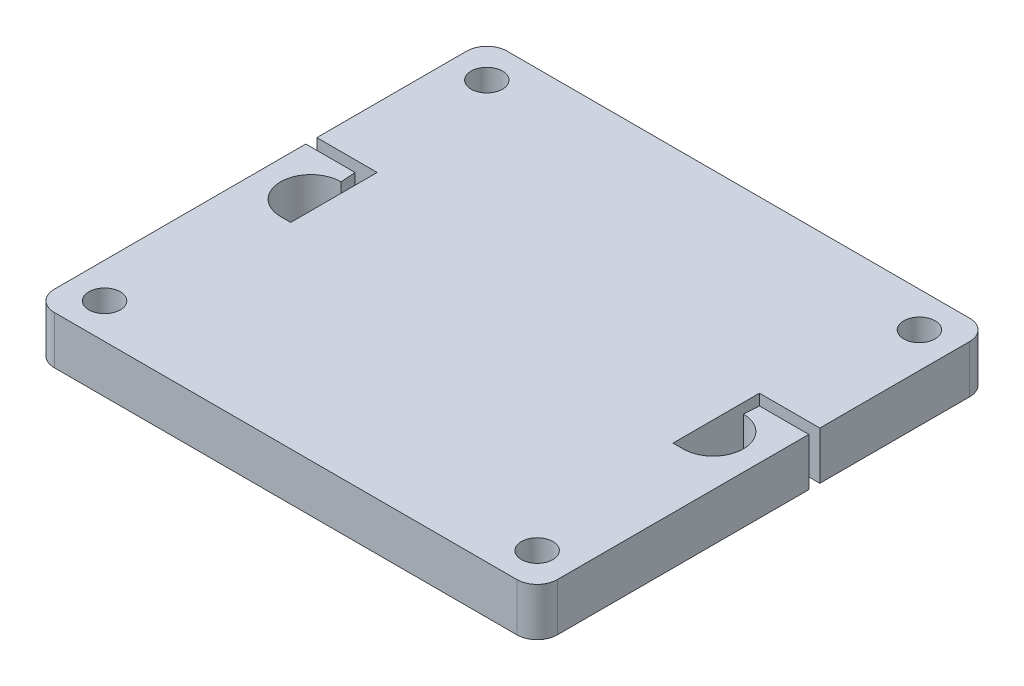
ISO-10303-21;
HEADER;
FILE_DESCRIPTION(('STEP AP214'),'2;1');
FILE_NAME('part.step','',(''),(''),'','','');
FILE_SCHEMA(('AUTOMOTIVE_DESIGN { 1 0 10303 214 1 1 1 1 }'));
ENDSEC;
DATA;
#1=APPLICATION_CONTEXT('core data for automotive mechanical design processes');
#2=APPLICATION_PROTOCOL_DEFINITION('international standard','automotive_design',2000,#1);
#3=PRODUCT_CONTEXT('',#1,'mechanical');
#4=PRODUCT('Part','Part','',(#3));
#5=PRODUCT_RELATED_PRODUCT_CATEGORY('part','',(#4));
#6=PRODUCT_DEFINITION_FORMATION('','',#4);
#7=PRODUCT_DEFINITION_CONTEXT('part definition',#1,'design');
#8=PRODUCT_DEFINITION('design','',#6,#7);
#9=PRODUCT_DEFINITION_SHAPE('','',#8);
#10=(LENGTH_UNIT() NAMED_UNIT(*) SI_UNIT(.MILLI.,.METRE.));
#11=(NAMED_UNIT(*) PLANE_ANGLE_UNIT() SI_UNIT($,.RADIAN.));
#12=(NAMED_UNIT(*) SI_UNIT($,.STERADIAN.) SOLID_ANGLE_UNIT());
#13=UNCERTAINTY_MEASURE_WITH_UNIT(LENGTH_MEASURE(1.E-05),#10,'distance_accuracy_value','');
#14=(GEOMETRIC_REPRESENTATION_CONTEXT(3) GLOBAL_UNCERTAINTY_ASSIGNED_CONTEXT((#13)) GLOBAL_UNIT_ASSIGNED_CONTEXT((#10,
#11,#12)) REPRESENTATION_CONTEXT('',''));
#15=CARTESIAN_POINT('',(0.,0.,0.));
#16=DIRECTION('',(0.,0.,1.));
#17=DIRECTION('',(1.,0.,0.));
#18=AXIS2_PLACEMENT_3D('',#15,#16,#17);
#19=CARTESIAN_POINT('',(-25.,4.7625,22.5));
#20=DIRECTION('',(0.,1.,0.));
#21=DIRECTION('',(0.,0.,1.));
#22=AXIS2_PLACEMENT_3D('',#19,#20,#21);
#23=PLANE('',#22);
#24=CARTESIAN_POINT('',(-21.5,4.7625,19.));
#25=DIRECTION('',(0.,1.,0.));
#26=DIRECTION('',(0.,0.,-1.));
#27=AXIS2_PLACEMENT_3D('',#24,#25,#26);
#28=CIRCLE('',#27,1.5625);
#29=CARTESIAN_POINT('',(-21.5,4.7625,17.4375));
#30=VERTEX_POINT('',#29);
#31=EDGE_CURVE('E286',#30,#30,#28,.T.);
#32=ORIENTED_EDGE('',*,*,#31,.F.);
#33=EDGE_LOOP('',(#32));
#34=FACE_BOUND('',#33,.T.);
#35=CARTESIAN_POINT('',(21.5,4.7625,-19.));
#36=DIRECTION('',(0.,1.,0.));
#37=DIRECTION('',(0.,0.,-1.));
#38=AXIS2_PLACEMENT_3D('',#35,#36,#37);
#39=CIRCLE('',#38,1.5625);
#40=CARTESIAN_POINT('',(21.5,4.7625,-20.5625));
#41=VERTEX_POINT('',#40);
#42=EDGE_CURVE('E298',#41,#41,#39,.T.);
#43=ORIENTED_EDGE('',*,*,#42,.F.);
#44=EDGE_LOOP('',(#43));
#45=FACE_BOUND('',#44,.T.);
#46=CARTESIAN_POINT('',(-21.5,4.7625,-19.));
#47=DIRECTION('',(0.,1.,0.));
#48=DIRECTION('',(0.,0.,1.));
#49=AXIS2_PLACEMENT_3D('',#46,#47,#48);
#50=CIRCLE('',#49,1.5625);
#51=CARTESIAN_POINT('',(-21.5,4.7625,-17.4375));
#52=VERTEX_POINT('',#51);
#53=EDGE_CURVE('E304',#52,#52,#50,.T.);
#54=ORIENTED_EDGE('',*,*,#53,.F.);
#55=EDGE_LOOP('',(#54));
#56=FACE_BOUND('',#55,.T.);
#57=CARTESIAN_POINT('',(21.5,4.7625,19.));
#58=DIRECTION('',(0.,1.,0.));
#59=DIRECTION('',(0.,0.,1.));
#60=AXIS2_PLACEMENT_3D('',#57,#58,#59);
#61=CIRCLE('',#60,1.5625);
#62=CARTESIAN_POINT('',(21.5,4.7625,20.5625));
#63=VERTEX_POINT('',#62);
#64=EDGE_CURVE('E292',#63,#63,#61,.T.);
#65=ORIENTED_EDGE('',*,*,#64,.F.);
#66=EDGE_LOOP('',(#65));
#67=FACE_BOUND('',#66,.T.);
#68=DIRECTION('',(0.,0.,-1.));
#69=VECTOR('',#68,1.);
#70=CARTESIAN_POINT('',(25.,4.7625,-22.5));
#71=LINE('',#70,#69);
#72=CARTESIAN_POINT('',(25.,4.7625,20.5));
#73=VERTEX_POINT('',#72);
#74=CARTESIAN_POINT('',(25.,4.7625,-4.5));
#75=VERTEX_POINT('',#74);
#76=EDGE_CURVE('E318',#73,#75,#71,.T.);
#77=ORIENTED_EDGE('',*,*,#76,.T.);
#78=DIRECTION('',(-1.,0.,0.));
#79=VECTOR('',#78,1.);
#80=CARTESIAN_POINT('',(20.1,4.7625,-4.5));
#81=LINE('',#80,#79);
#82=CARTESIAN_POINT('',(20.1,4.7625,-4.5));
#83=VERTEX_POINT('',#82);
#84=EDGE_CURVE('E202',#75,#83,#81,.T.);
#85=ORIENTED_EDGE('',*,*,#84,.T.);
#86=DIRECTION('',(-0.0665190105237735,0.,0.997785157856609));
#87=VECTOR('',#86,1.);
#88=CARTESIAN_POINT('',(20.,4.7625,-3.));
#89=LINE('',#88,#87);
#90=CARTESIAN_POINT('',(20.,4.7625,-3.));
#91=VERTEX_POINT('',#90);
#92=EDGE_CURVE('E205',#83,#91,#89,.T.);
#93=ORIENTED_EDGE('',*,*,#92,.T.);
#94=CARTESIAN_POINT('',(20.,4.7625,0.));
#95=DIRECTION('',(0.,-1.,0.));
#96=DIRECTION('',(0.,0.,-1.));
#97=AXIS2_PLACEMENT_3D('',#94,#95,#96);
#98=CIRCLE('',#97,3.);
#99=CARTESIAN_POINT('',(20.,4.7625,3.));
#100=VERTEX_POINT('',#99);
#101=EDGE_CURVE('E221',#91,#100,#98,.T.);
#102=ORIENTED_EDGE('',*,*,#101,.T.);
#103=DIRECTION('',(-1.,0.,0.));
#104=VECTOR('',#103,1.);
#105=CARTESIAN_POINT('',(20.,4.7625,3.));
#106=LINE('',#105,#104);
#107=CARTESIAN_POINT('',(19.,4.7625,3.));
#108=VERTEX_POINT('',#107);
#109=EDGE_CURVE('E218',#100,#108,#106,.T.);
#110=ORIENTED_EDGE('',*,*,#109,.T.);
#111=DIRECTION('',(0.,0.,-1.));
#112=VECTOR('',#111,1.);
#113=CARTESIAN_POINT('',(19.,4.7625,-5.6));
#114=LINE('',#113,#112);
#115=CARTESIAN_POINT('',(19.,4.7625,-5.6));
#116=VERTEX_POINT('',#115);
#117=EDGE_CURVE('E216',#108,#116,#114,.T.);
#118=ORIENTED_EDGE('',*,*,#117,.T.);
#119=DIRECTION('',(1.,0.,0.));
#120=VECTOR('',#119,1.);
#121=CARTESIAN_POINT('',(25.,4.7625,-5.6));
#122=LINE('',#121,#120);
#123=CARTESIAN_POINT('',(25.,4.7625,-5.6));
#124=VERTEX_POINT('',#123);
#125=EDGE_CURVE('E193',#116,#124,#122,.T.);
#126=ORIENTED_EDGE('',*,*,#125,.T.);
#127=CARTESIAN_POINT('',(25.,4.7625,-20.5));
#128=VERTEX_POINT('',#127);
#129=EDGE_CURVE('E317',#124,#128,#71,.T.);
#130=ORIENTED_EDGE('',*,*,#129,.T.);
#131=CARTESIAN_POINT('',(23.,4.7625,-20.5));
#132=DIRECTION('',(0.,1.,0.));
#133=DIRECTION('',(0.,0.,1.));
#134=AXIS2_PLACEMENT_3D('',#131,#132,#133);
#135=CIRCLE('',#134,2.);
#136=CARTESIAN_POINT('',(23.,4.7625,-22.5));
#137=VERTEX_POINT('',#136);
#138=EDGE_CURVE('E358',#128,#137,#135,.T.);
#139=ORIENTED_EDGE('',*,*,#138,.T.);
#140=DIRECTION('',(-1.,0.,0.));
#141=VECTOR('',#140,1.);
#142=CARTESIAN_POINT('',(-25.,4.7625,-22.5));
#143=LINE('',#142,#141);
#144=CARTESIAN_POINT('',(-23.,4.7625,-22.5));
#145=VERTEX_POINT('',#144);
#146=EDGE_CURVE('E321',#137,#145,#143,.T.);
#147=ORIENTED_EDGE('',*,*,#146,.T.);
#148=CARTESIAN_POINT('',(-23.,4.7625,-20.5));
#149=DIRECTION('',(0.,1.,0.));
#150=DIRECTION('',(0.,0.,1.));
#151=AXIS2_PLACEMENT_3D('',#148,#149,#150);
#152=CIRCLE('',#151,2.);
#153=CARTESIAN_POINT('',(-25.,4.7625,-20.5));
#154=VERTEX_POINT('',#153);
#155=EDGE_CURVE('E362',#145,#154,#152,.T.);
#156=ORIENTED_EDGE('',*,*,#155,.T.);
#157=DIRECTION('',(0.,0.,1.));
#158=VECTOR('',#157,1.);
#159=CARTESIAN_POINT('',(-25.,4.7625,-22.5));
#160=LINE('',#159,#158);
#161=CARTESIAN_POINT('',(-25.,4.7625,-5.6));
#162=VERTEX_POINT('',#161);
#163=EDGE_CURVE('E310',#154,#162,#160,.T.);
#164=ORIENTED_EDGE('',*,*,#163,.T.);
#165=DIRECTION('',(-1.,0.,0.));
#166=VECTOR('',#165,1.);
#167=CARTESIAN_POINT('',(-25.,4.7625,-5.6));
#168=LINE('',#167,#166);
#169=CARTESIAN_POINT('',(-19.,4.7625,-5.6));
#170=VERTEX_POINT('',#169);
#171=EDGE_CURVE('E240',#170,#162,#168,.T.);
#172=ORIENTED_EDGE('',*,*,#171,.F.);
#173=DIRECTION('',(0.,0.,-1.));
#174=VECTOR('',#173,1.);
#175=CARTESIAN_POINT('',(-19.,4.7625,-5.6));
#176=LINE('',#175,#174);
#177=CARTESIAN_POINT('',(-19.,4.7625,3.));
#178=VERTEX_POINT('',#177);
#179=EDGE_CURVE('E267',#178,#170,#176,.T.);
#180=ORIENTED_EDGE('',*,*,#179,.F.);
#181=DIRECTION('',(1.,0.,0.));
#182=VECTOR('',#181,1.);
#183=CARTESIAN_POINT('',(-20.,4.7625,3.));
#184=LINE('',#183,#182);
#185=CARTESIAN_POINT('',(-20.,4.7625,3.));
#186=VERTEX_POINT('',#185);
#187=EDGE_CURVE('E264',#186,#178,#184,.T.);
#188=ORIENTED_EDGE('',*,*,#187,.F.);
#189=CARTESIAN_POINT('',(-20.,4.7625,0.));
#190=DIRECTION('',(0.,1.,0.));
#191=DIRECTION('',(0.,0.,-1.));
#192=AXIS2_PLACEMENT_3D('',#189,#190,#191);
#193=CIRCLE('',#192,3.);
#194=CARTESIAN_POINT('',(-20.,4.7625,-3.));
#195=VERTEX_POINT('',#194);
#196=EDGE_CURVE('E261',#195,#186,#193,.T.);
#197=ORIENTED_EDGE('',*,*,#196,.F.);
#198=DIRECTION('',(0.0665190105237735,0.,0.997785157856609));
#199=VECTOR('',#198,1.);
#200=CARTESIAN_POINT('',(-20.,4.7625,-3.));
#201=LINE('',#200,#199);
#202=CARTESIAN_POINT('',(-20.1,4.7625,-4.5));
#203=VERTEX_POINT('',#202);
#204=EDGE_CURVE('E258',#203,#195,#201,.T.);
#205=ORIENTED_EDGE('',*,*,#204,.F.);
#206=DIRECTION('',(1.,0.,0.));
#207=VECTOR('',#206,1.);
#208=CARTESIAN_POINT('',(-20.1,4.7625,-4.5));
#209=LINE('',#208,#207);
#210=CARTESIAN_POINT('',(-25.,4.7625,-4.5));
#211=VERTEX_POINT('',#210);
#212=EDGE_CURVE('E229',#211,#203,#209,.T.);
#213=ORIENTED_EDGE('',*,*,#212,.F.);
#214=CARTESIAN_POINT('',(-25.,4.7625,20.5));
#215=VERTEX_POINT('',#214);
#216=EDGE_CURVE('E314',#211,#215,#160,.T.);
#217=ORIENTED_EDGE('',*,*,#216,.T.);
#218=CARTESIAN_POINT('',(-23.,4.7625,20.5));
#219=DIRECTION('',(0.,1.,0.));
#220=DIRECTION('',(0.,0.,1.));
#221=AXIS2_PLACEMENT_3D('',#218,#219,#220);
#222=CIRCLE('',#221,2.);
#223=CARTESIAN_POINT('',(-23.,4.7625,22.5));
#224=VERTEX_POINT('',#223);
#225=EDGE_CURVE('E360',#215,#224,#222,.T.);
#226=ORIENTED_EDGE('',*,*,#225,.T.);
#227=DIRECTION('',(1.,0.,0.));
#228=VECTOR('',#227,1.);
#229=CARTESIAN_POINT('',(-25.,4.7625,22.5));
#230=LINE('',#229,#228);
#231=CARTESIAN_POINT('',(23.,4.7625,22.5));
#232=VERTEX_POINT('',#231);
#233=EDGE_CURVE('E313',#224,#232,#230,.T.);
#234=ORIENTED_EDGE('',*,*,#233,.T.);
#235=CARTESIAN_POINT('',(23.,4.7625,20.5));
#236=DIRECTION('',(0.,1.,0.));
#237=DIRECTION('',(0.,0.,1.));
#238=AXIS2_PLACEMENT_3D('',#235,#236,#237);
#239=CIRCLE('',#238,2.);
#240=EDGE_CURVE('E356',#232,#73,#239,.T.);
#241=ORIENTED_EDGE('',*,*,#240,.T.);
#242=EDGE_LOOP('',(#77,#85,#93,#102,#110,#118,#126,#130,#139,#147,#156,#164,#172,#180,#188,#197,
#205,#213,#217,#226,#234,#241));
#243=FACE_BOUND('',#242,.T.);
#244=ADVANCED_FACE('F31',(#34,#45,#56,#67,#243),#23,.T.);
#245=CARTESIAN_POINT('',(-25.,0.,22.5));
#246=DIRECTION('',(0.,1.,0.));
#247=DIRECTION('',(0.,0.,1.));
#248=AXIS2_PLACEMENT_3D('',#245,#246,#247);
#249=PLANE('',#248);
#250=CARTESIAN_POINT('',(-21.5,0.,19.));
#251=DIRECTION('',(0.,1.,0.));
#252=DIRECTION('',(0.,0.,-1.));
#253=AXIS2_PLACEMENT_3D('',#250,#251,#252);
#254=CIRCLE('',#253,1.5625);
#255=CARTESIAN_POINT('',(-21.5,0.,17.4375));
#256=VERTEX_POINT('',#255);
#257=EDGE_CURVE('E274',#256,#256,#254,.T.);
#258=ORIENTED_EDGE('',*,*,#257,.T.);
#259=EDGE_LOOP('',(#258));
#260=FACE_BOUND('',#259,.T.);
#261=CARTESIAN_POINT('',(21.5,0.,-19.));
#262=DIRECTION('',(0.,1.,0.));
#263=DIRECTION('',(0.,0.,-1.));
#264=AXIS2_PLACEMENT_3D('',#261,#262,#263);
#265=CIRCLE('',#264,1.5625);
#266=CARTESIAN_POINT('',(21.5,0.,-20.5625));
#267=VERTEX_POINT('',#266);
#268=EDGE_CURVE('E295',#267,#267,#265,.T.);
#269=ORIENTED_EDGE('',*,*,#268,.T.);
#270=EDGE_LOOP('',(#269));
#271=FACE_BOUND('',#270,.T.);
#272=CARTESIAN_POINT('',(-21.5,0.,-19.));
#273=DIRECTION('',(0.,1.,0.));
#274=DIRECTION('',(0.,0.,1.));
#275=AXIS2_PLACEMENT_3D('',#272,#273,#274);
#276=CIRCLE('',#275,1.5625);
#277=CARTESIAN_POINT('',(-21.5,0.,-17.4375));
#278=VERTEX_POINT('',#277);
#279=EDGE_CURVE('E301',#278,#278,#276,.T.);
#280=ORIENTED_EDGE('',*,*,#279,.T.);
#281=EDGE_LOOP('',(#280));
#282=FACE_BOUND('',#281,.T.);
#283=CARTESIAN_POINT('',(21.5,0.,19.));
#284=DIRECTION('',(0.,1.,0.));
#285=DIRECTION('',(0.,0.,1.));
#286=AXIS2_PLACEMENT_3D('',#283,#284,#285);
#287=CIRCLE('',#286,1.5625);
#288=CARTESIAN_POINT('',(21.5,0.,20.5625));
#289=VERTEX_POINT('',#288);
#290=EDGE_CURVE('E289',#289,#289,#287,.T.);
#291=ORIENTED_EDGE('',*,*,#290,.T.);
#292=EDGE_LOOP('',(#291));
#293=FACE_BOUND('',#292,.T.);
#294=DIRECTION('',(-1.,0.,0.));
#295=VECTOR('',#294,1.);
#296=CARTESIAN_POINT('',(20.1,0.,-4.5));
#297=LINE('',#296,#295);
#298=CARTESIAN_POINT('',(25.,0.,-4.5));
#299=VERTEX_POINT('',#298);
#300=CARTESIAN_POINT('',(20.1,0.,-4.5));
#301=VERTEX_POINT('',#300);
#302=EDGE_CURVE('E213',#299,#301,#297,.T.);
#303=ORIENTED_EDGE('',*,*,#302,.F.);
#304=DIRECTION('',(0.,0.,-1.));
#305=VECTOR('',#304,1.);
#306=CARTESIAN_POINT('',(25.,0.,-22.5));
#307=LINE('',#306,#305);
#308=CARTESIAN_POINT('',(25.,0.,20.5));
#309=VERTEX_POINT('',#308);
#310=EDGE_CURVE('E331',#309,#299,#307,.T.);
#311=ORIENTED_EDGE('',*,*,#310,.F.);
#312=CARTESIAN_POINT('',(23.,0.,20.5));
#313=DIRECTION('',(0.,1.,0.));
#314=DIRECTION('',(0.,0.,1.));
#315=AXIS2_PLACEMENT_3D('',#312,#313,#314);
#316=CIRCLE('',#315,2.);
#317=CARTESIAN_POINT('',(23.,0.,22.5));
#318=VERTEX_POINT('',#317);
#319=EDGE_CURVE('E342',#309,#318,#316,.F.);
#320=ORIENTED_EDGE('',*,*,#319,.T.);
#321=DIRECTION('',(1.,0.,0.));
#322=VECTOR('',#321,1.);
#323=CARTESIAN_POINT('',(-25.,0.,22.5));
#324=LINE('',#323,#322);
#325=CARTESIAN_POINT('',(-23.,0.,22.5));
#326=VERTEX_POINT('',#325);
#327=EDGE_CURVE('E328',#326,#318,#324,.T.);
#328=ORIENTED_EDGE('',*,*,#327,.F.);
#329=CARTESIAN_POINT('',(-23.,0.,20.5));
#330=DIRECTION('',(0.,1.,0.));
#331=DIRECTION('',(0.,0.,1.));
#332=AXIS2_PLACEMENT_3D('',#329,#330,#331);
#333=CIRCLE('',#332,2.);
#334=CARTESIAN_POINT('',(-25.,0.,20.5));
#335=VERTEX_POINT('',#334);
#336=EDGE_CURVE('E346',#326,#335,#333,.F.);
#337=ORIENTED_EDGE('',*,*,#336,.T.);
#338=DIRECTION('',(0.,0.,1.));
#339=VECTOR('',#338,1.);
#340=CARTESIAN_POINT('',(-25.,0.,-22.5));
#341=LINE('',#340,#339);
#342=CARTESIAN_POINT('',(-25.,0.,-4.5));
#343=VERTEX_POINT('',#342);
#344=EDGE_CURVE('E307',#343,#335,#341,.T.);
#345=ORIENTED_EDGE('',*,*,#344,.F.);
#346=DIRECTION('',(1.,0.,0.));
#347=VECTOR('',#346,1.);
#348=CARTESIAN_POINT('',(-20.1,0.,-4.5));
#349=LINE('',#348,#347);
#350=CARTESIAN_POINT('',(-20.1,0.,-4.5));
#351=VERTEX_POINT('',#350);
#352=EDGE_CURVE('E54',#343,#351,#349,.T.);
#353=ORIENTED_EDGE('',*,*,#352,.T.);
#354=DIRECTION('',(0.0665190105237735,0.,0.997785157856609));
#355=VECTOR('',#354,1.);
#356=CARTESIAN_POINT('',(-20.,0.,-3.));
#357=LINE('',#356,#355);
#358=CARTESIAN_POINT('',(-20.,0.,-3.));
#359=VERTEX_POINT('',#358);
#360=EDGE_CURVE('E239',#351,#359,#357,.T.);
#361=ORIENTED_EDGE('',*,*,#360,.T.);
#362=CARTESIAN_POINT('',(-20.,0.,0.));
#363=DIRECTION('',(0.,1.,0.));
#364=DIRECTION('',(0.,0.,-1.));
#365=AXIS2_PLACEMENT_3D('',#362,#363,#364);
#366=CIRCLE('',#365,3.);
#367=CARTESIAN_POINT('',(-20.,0.,3.));
#368=VERTEX_POINT('',#367);
#369=EDGE_CURVE('E243',#359,#368,#366,.T.);
#370=ORIENTED_EDGE('',*,*,#369,.T.);
#371=DIRECTION('',(1.,0.,0.));
#372=VECTOR('',#371,1.);
#373=CARTESIAN_POINT('',(-20.,0.,3.));
#374=LINE('',#373,#372);
#375=CARTESIAN_POINT('',(-19.,0.,3.));
#376=VERTEX_POINT('',#375);
#377=EDGE_CURVE('E246',#368,#376,#374,.T.);
#378=ORIENTED_EDGE('',*,*,#377,.T.);
#379=DIRECTION('',(0.,0.,-1.));
#380=VECTOR('',#379,1.);
#381=CARTESIAN_POINT('',(-19.,0.,-5.6));
#382=LINE('',#381,#380);
#383=CARTESIAN_POINT('',(-19.,0.,-5.6));
#384=VERTEX_POINT('',#383);
#385=EDGE_CURVE('E249',#376,#384,#382,.T.);
#386=ORIENTED_EDGE('',*,*,#385,.T.);
#387=DIRECTION('',(-1.,0.,0.));
#388=VECTOR('',#387,1.);
#389=CARTESIAN_POINT('',(-25.,0.,-5.6));
#390=LINE('',#389,#388);
#391=CARTESIAN_POINT('',(-25.,0.,-5.6));
#392=VERTEX_POINT('',#391);
#393=EDGE_CURVE('E252',#384,#392,#390,.T.);
#394=ORIENTED_EDGE('',*,*,#393,.T.);
#395=CARTESIAN_POINT('',(-25.,0.,-20.5));
#396=VERTEX_POINT('',#395);
#397=EDGE_CURVE('E325',#396,#392,#341,.T.);
#398=ORIENTED_EDGE('',*,*,#397,.F.);
#399=CARTESIAN_POINT('',(-23.,0.,-20.5));
#400=DIRECTION('',(0.,1.,0.));
#401=DIRECTION('',(0.,0.,1.));
#402=AXIS2_PLACEMENT_3D('',#399,#400,#401);
#403=CIRCLE('',#402,2.);
#404=CARTESIAN_POINT('',(-23.,0.,-22.5));
#405=VERTEX_POINT('',#404);
#406=EDGE_CURVE('E349',#396,#405,#403,.F.);
#407=ORIENTED_EDGE('',*,*,#406,.T.);
#408=DIRECTION('',(-1.,0.,0.));
#409=VECTOR('',#408,1.);
#410=CARTESIAN_POINT('',(-25.,0.,-22.5));
#411=LINE('',#410,#409);
#412=CARTESIAN_POINT('',(23.,0.,-22.5));
#413=VERTEX_POINT('',#412);
#414=EDGE_CURVE('E334',#413,#405,#411,.T.);
#415=ORIENTED_EDGE('',*,*,#414,.F.);
#416=CARTESIAN_POINT('',(23.,0.,-20.5));
#417=DIRECTION('',(0.,1.,0.));
#418=DIRECTION('',(0.,0.,1.));
#419=AXIS2_PLACEMENT_3D('',#416,#417,#418);
#420=CIRCLE('',#419,2.);
#421=CARTESIAN_POINT('',(25.,0.,-20.5));
#422=VERTEX_POINT('',#421);
#423=EDGE_CURVE('E344',#413,#422,#420,.F.);
#424=ORIENTED_EDGE('',*,*,#423,.T.);
#425=CARTESIAN_POINT('',(25.,0.,-5.6));
#426=VERTEX_POINT('',#425);
#427=EDGE_CURVE('E201',#426,#422,#307,.T.);
#428=ORIENTED_EDGE('',*,*,#427,.F.);
#429=DIRECTION('',(1.,0.,0.));
#430=VECTOR('',#429,1.);
#431=CARTESIAN_POINT('',(25.,0.,-5.6));
#432=LINE('',#431,#430);
#433=CARTESIAN_POINT('',(19.,0.,-5.6));
#434=VERTEX_POINT('',#433);
#435=EDGE_CURVE('E46',#434,#426,#432,.T.);
#436=ORIENTED_EDGE('',*,*,#435,.F.);
#437=DIRECTION('',(0.,0.,-1.));
#438=VECTOR('',#437,1.);
#439=CARTESIAN_POINT('',(19.,0.,-5.6));
#440=LINE('',#439,#438);
#441=CARTESIAN_POINT('',(19.,0.,3.));
#442=VERTEX_POINT('',#441);
#443=EDGE_CURVE('E181',#442,#434,#440,.T.);
#444=ORIENTED_EDGE('',*,*,#443,.F.);
#445=DIRECTION('',(-1.,0.,0.));
#446=VECTOR('',#445,1.);
#447=CARTESIAN_POINT('',(20.,0.,3.));
#448=LINE('',#447,#446);
#449=CARTESIAN_POINT('',(20.,0.,3.));
#450=VERTEX_POINT('',#449);
#451=EDGE_CURVE('E189',#450,#442,#448,.T.);
#452=ORIENTED_EDGE('',*,*,#451,.F.);
#453=CARTESIAN_POINT('',(20.,0.,0.));
#454=DIRECTION('',(0.,-1.,0.));
#455=DIRECTION('',(0.,0.,-1.));
#456=AXIS2_PLACEMENT_3D('',#453,#454,#455);
#457=CIRCLE('',#456,3.);
#458=CARTESIAN_POINT('',(20.,0.,-3.));
#459=VERTEX_POINT('',#458);
#460=EDGE_CURVE('E209',#459,#450,#457,.T.);
#461=ORIENTED_EDGE('',*,*,#460,.F.);
#462=DIRECTION('',(-0.0665190105237735,0.,0.997785157856609));
#463=VECTOR('',#462,1.);
#464=CARTESIAN_POINT('',(20.,0.,-3.));
#465=LINE('',#464,#463);
#466=EDGE_CURVE('E211',#301,#459,#465,.T.);
#467=ORIENTED_EDGE('',*,*,#466,.F.);
#468=EDGE_LOOP('',(#303,#311,#320,#328,#337,#345,#353,#361,#370,#378,#386,#394,#398,#407,#415,
#424,#428,#436,#444,#452,#461,#467));
#469=FACE_BOUND('',#468,.T.);
#470=ADVANCED_FACE('F199',(#260,#271,#282,#293,#469),#249,.F.);
#471=CARTESIAN_POINT('',(25.,4.7625,-22.5));
#472=DIRECTION('',(-1.,0.,0.));
#473=DIRECTION('',(0.,0.,1.));
#474=AXIS2_PLACEMENT_3D('',#471,#472,#473);
#475=PLANE('',#474);
#476=DIRECTION('',(0.,1.,0.));
#477=VECTOR('',#476,1.);
#478=CARTESIAN_POINT('',(25.,0.,-4.5));
#479=LINE('',#478,#477);
#480=EDGE_CURVE('E226',#299,#75,#479,.T.);
#481=ORIENTED_EDGE('',*,*,#480,.T.);
#482=ORIENTED_EDGE('',*,*,#76,.F.);
#483=DIRECTION('',(0.,-1.,0.));
#484=VECTOR('',#483,1.);
#485=CARTESIAN_POINT('',(25.,4.7625,20.5));
#486=LINE('',#485,#484);
#487=EDGE_CURVE('E39',#73,#309,#486,.T.);
#488=ORIENTED_EDGE('',*,*,#487,.T.);
#489=ORIENTED_EDGE('',*,*,#310,.T.);
#490=EDGE_LOOP('',(#481,#482,#488,#489));
#491=FACE_BOUND('',#490,.T.);
#492=ADVANCED_FACE('F373',(#491),#475,.F.);
#493=DIRECTION('',(0.,1.,0.));
#494=VECTOR('',#493,1.);
#495=CARTESIAN_POINT('',(25.,0.,-5.6));
#496=LINE('',#495,#494);
#497=EDGE_CURVE('E195',#426,#124,#496,.T.);
#498=ORIENTED_EDGE('',*,*,#497,.F.);
#499=ORIENTED_EDGE('',*,*,#427,.T.);
#500=DIRECTION('',(0.,-1.,0.));
#501=VECTOR('',#500,1.);
#502=CARTESIAN_POINT('',(25.,4.7625,-20.5));
#503=LINE('',#502,#501);
#504=EDGE_CURVE('E11',#422,#128,#503,.F.);
#505=ORIENTED_EDGE('',*,*,#504,.T.);
#506=ORIENTED_EDGE('',*,*,#129,.F.);
#507=EDGE_LOOP('',(#498,#499,#505,#506));
#508=FACE_BOUND('',#507,.T.);
#509=ADVANCED_FACE('F441',(#508),#475,.F.);
#510=CARTESIAN_POINT('',(-25.,4.7625,-22.5));
#511=DIRECTION('',(1.,0.,0.));
#512=DIRECTION('',(0.,0.,-1.));
#513=AXIS2_PLACEMENT_3D('',#510,#511,#512);
#514=PLANE('',#513);
#515=ORIENTED_EDGE('',*,*,#397,.T.);
#516=DIRECTION('',(0.,1.,0.));
#517=VECTOR('',#516,1.);
#518=CARTESIAN_POINT('',(-25.,0.,-5.6));
#519=LINE('',#518,#517);
#520=EDGE_CURVE('E271',#392,#162,#519,.T.);
#521=ORIENTED_EDGE('',*,*,#520,.T.);
#522=ORIENTED_EDGE('',*,*,#163,.F.);
#523=DIRECTION('',(0.,-1.,0.));
#524=VECTOR('',#523,1.);
#525=CARTESIAN_POINT('',(-25.,4.7625,-20.5));
#526=LINE('',#525,#524);
#527=EDGE_CURVE('E339',#154,#396,#526,.T.);
#528=ORIENTED_EDGE('',*,*,#527,.T.);
#529=EDGE_LOOP('',(#515,#521,#522,#528));
#530=FACE_BOUND('',#529,.T.);
#531=ADVANCED_FACE('F423',(#530),#514,.F.);
#532=ORIENTED_EDGE('',*,*,#216,.F.);
#533=DIRECTION('',(0.,1.,0.));
#534=VECTOR('',#533,1.);
#535=CARTESIAN_POINT('',(-25.,0.,-4.5));
#536=LINE('',#535,#534);
#537=EDGE_CURVE('E255',#343,#211,#536,.T.);
#538=ORIENTED_EDGE('',*,*,#537,.F.);
#539=ORIENTED_EDGE('',*,*,#344,.T.);
#540=DIRECTION('',(0.,-1.,0.));
#541=VECTOR('',#540,1.);
#542=CARTESIAN_POINT('',(-25.,4.7625,20.5));
#543=LINE('',#542,#541);
#544=EDGE_CURVE('E324',#335,#215,#543,.F.);
#545=ORIENTED_EDGE('',*,*,#544,.T.);
#546=EDGE_LOOP('',(#532,#538,#539,#545));
#547=FACE_BOUND('',#546,.T.);
#548=ADVANCED_FACE('F400',(#547),#514,.F.);
#549=CARTESIAN_POINT('',(-25.,4.7625,22.5));
#550=DIRECTION('',(0.,0.,-1.));
#551=DIRECTION('',(-1.,0.,0.));
#552=AXIS2_PLACEMENT_3D('',#549,#550,#551);
#553=PLANE('',#552);
#554=ORIENTED_EDGE('',*,*,#233,.F.);
#555=DIRECTION('',(0.,-1.,0.));
#556=VECTOR('',#555,1.);
#557=CARTESIAN_POINT('',(-23.,4.7625,22.5));
#558=LINE('',#557,#556);
#559=EDGE_CURVE('E366',#224,#326,#558,.T.);
#560=ORIENTED_EDGE('',*,*,#559,.T.);
#561=ORIENTED_EDGE('',*,*,#327,.T.);
#562=DIRECTION('',(0.,-1.,0.));
#563=VECTOR('',#562,1.);
#564=CARTESIAN_POINT('',(23.,4.7625,22.5));
#565=LINE('',#564,#563);
#566=EDGE_CURVE('E364',#318,#232,#565,.F.);
#567=ORIENTED_EDGE('',*,*,#566,.T.);
#568=EDGE_LOOP('',(#554,#560,#561,#567));
#569=FACE_BOUND('',#568,.T.);
#570=ADVANCED_FACE('F391',(#569),#553,.F.);
#571=CARTESIAN_POINT('',(-25.,4.7625,-22.5));
#572=DIRECTION('',(0.,0.,1.));
#573=DIRECTION('',(1.,0.,0.));
#574=AXIS2_PLACEMENT_3D('',#571,#572,#573);
#575=PLANE('',#574);
#576=ORIENTED_EDGE('',*,*,#414,.T.);
#577=DIRECTION('',(0.,-1.,0.));
#578=VECTOR('',#577,1.);
#579=CARTESIAN_POINT('',(-23.,4.7625,-22.5));
#580=LINE('',#579,#578);
#581=EDGE_CURVE('E354',#405,#145,#580,.F.);
#582=ORIENTED_EDGE('',*,*,#581,.T.);
#583=ORIENTED_EDGE('',*,*,#146,.F.);
#584=DIRECTION('',(0.,-1.,0.));
#585=VECTOR('',#584,1.);
#586=CARTESIAN_POINT('',(23.,4.7625,-22.5));
#587=LINE('',#586,#585);
#588=EDGE_CURVE('E351',#137,#413,#587,.T.);
#589=ORIENTED_EDGE('',*,*,#588,.T.);
#590=EDGE_LOOP('',(#576,#582,#583,#589));
#591=FACE_BOUND('',#590,.T.);
#592=ADVANCED_FACE('F432',(#591),#575,.F.);
#593=CARTESIAN_POINT('',(-21.5,4.7625,-19.));
#594=DIRECTION('',(0.,-1.,0.));
#595=DIRECTION('',(0.,0.,-1.));
#596=AXIS2_PLACEMENT_3D('',#593,#594,#595);
#597=CYLINDRICAL_SURFACE('',#596,1.5625);
#598=ORIENTED_EDGE('',*,*,#53,.T.);
#599=EDGE_LOOP('',(#598));
#600=FACE_BOUND('',#599,.T.);
#601=ORIENTED_EDGE('',*,*,#279,.F.);
#602=EDGE_LOOP('',(#601));
#603=FACE_BOUND('',#602,.T.);
#604=ADVANCED_FACE('F467',(#600,#603),#597,.F.);
#605=CARTESIAN_POINT('',(21.5,4.7625,-19.));
#606=DIRECTION('',(0.,-1.,0.));
#607=DIRECTION('',(0.,0.,-1.));
#608=AXIS2_PLACEMENT_3D('',#605,#606,#607);
#609=CYLINDRICAL_SURFACE('',#608,1.5625);
#610=ORIENTED_EDGE('',*,*,#42,.T.);
#611=EDGE_LOOP('',(#610));
#612=FACE_BOUND('',#611,.T.);
#613=ORIENTED_EDGE('',*,*,#268,.F.);
#614=EDGE_LOOP('',(#613));
#615=FACE_BOUND('',#614,.T.);
#616=ADVANCED_FACE('F511',(#612,#615),#609,.F.);
#617=CARTESIAN_POINT('',(21.5,4.7625,19.));
#618=DIRECTION('',(0.,-1.,0.));
#619=DIRECTION('',(0.,0.,-1.));
#620=AXIS2_PLACEMENT_3D('',#617,#618,#619);
#621=CYLINDRICAL_SURFACE('',#620,1.5625);
#622=ORIENTED_EDGE('',*,*,#64,.T.);
#623=EDGE_LOOP('',(#622));
#624=FACE_BOUND('',#623,.T.);
#625=ORIENTED_EDGE('',*,*,#290,.F.);
#626=EDGE_LOOP('',(#625));
#627=FACE_BOUND('',#626,.T.);
#628=ADVANCED_FACE('F508',(#624,#627),#621,.F.);
#629=CARTESIAN_POINT('',(-21.5,4.7625,19.));
#630=DIRECTION('',(0.,-1.,0.));
#631=DIRECTION('',(0.,0.,-1.));
#632=AXIS2_PLACEMENT_3D('',#629,#630,#631);
#633=CYLINDRICAL_SURFACE('',#632,1.5625);
#634=ORIENTED_EDGE('',*,*,#31,.T.);
#635=EDGE_LOOP('',(#634));
#636=FACE_BOUND('',#635,.T.);
#637=ORIENTED_EDGE('',*,*,#257,.F.);
#638=EDGE_LOOP('',(#637));
#639=FACE_BOUND('',#638,.T.);
#640=ADVANCED_FACE('F480',(#636,#639),#633,.F.);
#641=CARTESIAN_POINT('',(-23.,4.7625,-20.5));
#642=DIRECTION('',(0.,-1.,0.));
#643=DIRECTION('',(0.,0.,-1.));
#644=AXIS2_PLACEMENT_3D('',#641,#642,#643);
#645=CYLINDRICAL_SURFACE('',#644,2.);
#646=ORIENTED_EDGE('',*,*,#155,.F.);
#647=ORIENTED_EDGE('',*,*,#581,.F.);
#648=ORIENTED_EDGE('',*,*,#406,.F.);
#649=ORIENTED_EDGE('',*,*,#527,.F.);
#650=EDGE_LOOP('',(#646,#647,#648,#649));
#651=FACE_BOUND('',#650,.T.);
#652=ADVANCED_FACE('F428',(#651),#645,.T.);
#653=CARTESIAN_POINT('',(-23.,4.7625,20.5));
#654=DIRECTION('',(0.,-1.,0.));
#655=DIRECTION('',(0.,0.,-1.));
#656=AXIS2_PLACEMENT_3D('',#653,#654,#655);
#657=CYLINDRICAL_SURFACE('',#656,2.);
#658=ORIENTED_EDGE('',*,*,#225,.F.);
#659=ORIENTED_EDGE('',*,*,#544,.F.);
#660=ORIENTED_EDGE('',*,*,#336,.F.);
#661=ORIENTED_EDGE('',*,*,#559,.F.);
#662=EDGE_LOOP('',(#658,#659,#660,#661));
#663=FACE_BOUND('',#662,.T.);
#664=ADVANCED_FACE('F397',(#663),#657,.T.);
#665=CARTESIAN_POINT('',(23.,4.7625,-20.5));
#666=DIRECTION('',(0.,-1.,0.));
#667=DIRECTION('',(0.,0.,-1.));
#668=AXIS2_PLACEMENT_3D('',#665,#666,#667);
#669=CYLINDRICAL_SURFACE('',#668,2.);
#670=ORIENTED_EDGE('',*,*,#138,.F.);
#671=ORIENTED_EDGE('',*,*,#504,.F.);
#672=ORIENTED_EDGE('',*,*,#423,.F.);
#673=ORIENTED_EDGE('',*,*,#588,.F.);
#674=EDGE_LOOP('',(#670,#671,#672,#673));
#675=FACE_BOUND('',#674,.T.);
#676=ADVANCED_FACE('F437',(#675),#669,.T.);
#677=CARTESIAN_POINT('',(23.,4.7625,20.5));
#678=DIRECTION('',(0.,-1.,0.));
#679=DIRECTION('',(0.,0.,-1.));
#680=AXIS2_PLACEMENT_3D('',#677,#678,#679);
#681=CYLINDRICAL_SURFACE('',#680,2.);
#682=ORIENTED_EDGE('',*,*,#240,.F.);
#683=ORIENTED_EDGE('',*,*,#566,.F.);
#684=ORIENTED_EDGE('',*,*,#319,.F.);
#685=ORIENTED_EDGE('',*,*,#487,.F.);
#686=EDGE_LOOP('',(#682,#683,#684,#685));
#687=FACE_BOUND('',#686,.T.);
#688=ADVANCED_FACE('F33',(#687),#681,.T.);
#689=CARTESIAN_POINT('',(-25.,0.,-5.6));
#690=DIRECTION('',(0.,0.,-1.));
#691=DIRECTION('',(-1.,0.,0.));
#692=AXIS2_PLACEMENT_3D('',#689,#690,#691);
#693=PLANE('',#692);
#694=ORIENTED_EDGE('',*,*,#171,.T.);
#695=ORIENTED_EDGE('',*,*,#520,.F.);
#696=ORIENTED_EDGE('',*,*,#393,.F.);
#697=DIRECTION('',(0.,1.,0.));
#698=VECTOR('',#697,1.);
#699=CARTESIAN_POINT('',(-19.,0.,-5.6));
#700=LINE('',#699,#698);
#701=EDGE_CURVE('E275',#384,#170,#700,.T.);
#702=ORIENTED_EDGE('',*,*,#701,.T.);
#703=EDGE_LOOP('',(#694,#695,#696,#702));
#704=FACE_BOUND('',#703,.T.);
#705=ADVANCED_FACE('F486',(#704),#693,.F.);
#706=CARTESIAN_POINT('',(-19.,0.,-5.6));
#707=DIRECTION('',(1.,0.,0.));
#708=DIRECTION('',(0.,0.,-1.));
#709=AXIS2_PLACEMENT_3D('',#706,#707,#708);
#710=PLANE('',#709);
#711=ORIENTED_EDGE('',*,*,#179,.T.);
#712=ORIENTED_EDGE('',*,*,#701,.F.);
#713=ORIENTED_EDGE('',*,*,#385,.F.);
#714=DIRECTION('',(0.,1.,0.));
#715=VECTOR('',#714,1.);
#716=CARTESIAN_POINT('',(-19.,0.,3.));
#717=LINE('',#716,#715);
#718=EDGE_CURVE('E277',#376,#178,#717,.T.);
#719=ORIENTED_EDGE('',*,*,#718,.T.);
#720=EDGE_LOOP('',(#711,#712,#713,#719));
#721=FACE_BOUND('',#720,.T.);
#722=ADVANCED_FACE('F418',(#721),#710,.F.);
#723=CARTESIAN_POINT('',(-20.,0.,3.));
#724=DIRECTION('',(0.,0.,1.));
#725=DIRECTION('',(1.,0.,0.));
#726=AXIS2_PLACEMENT_3D('',#723,#724,#725);
#727=PLANE('',#726);
#728=ORIENTED_EDGE('',*,*,#187,.T.);
#729=ORIENTED_EDGE('',*,*,#718,.F.);
#730=ORIENTED_EDGE('',*,*,#377,.F.);
#731=DIRECTION('',(0.,1.,0.));
#732=VECTOR('',#731,1.);
#733=CARTESIAN_POINT('',(-20.,0.,3.));
#734=LINE('',#733,#732);
#735=EDGE_CURVE('E279',#368,#186,#734,.T.);
#736=ORIENTED_EDGE('',*,*,#735,.T.);
#737=EDGE_LOOP('',(#728,#729,#730,#736));
#738=FACE_BOUND('',#737,.T.);
#739=ADVANCED_FACE('F414',(#738),#727,.F.);
#740=CARTESIAN_POINT('',(-20.,0.,0.));
#741=DIRECTION('',(0.,1.,0.));
#742=DIRECTION('',(0.,0.,1.));
#743=AXIS2_PLACEMENT_3D('',#740,#741,#742);
#744=CYLINDRICAL_SURFACE('',#743,3.);
#745=ORIENTED_EDGE('',*,*,#196,.T.);
#746=ORIENTED_EDGE('',*,*,#735,.F.);
#747=ORIENTED_EDGE('',*,*,#369,.F.);
#748=DIRECTION('',(0.,1.,0.));
#749=VECTOR('',#748,1.);
#750=CARTESIAN_POINT('',(-20.,0.,-3.));
#751=LINE('',#750,#749);
#752=EDGE_CURVE('E281',#359,#195,#751,.T.);
#753=ORIENTED_EDGE('',*,*,#752,.T.);
#754=EDGE_LOOP('',(#745,#746,#747,#753));
#755=FACE_BOUND('',#754,.T.);
#756=ADVANCED_FACE('F412',(#755),#744,.F.);
#757=CARTESIAN_POINT('',(-20.,0.,-3.));
#758=DIRECTION('',(-0.997785157856609,0.,0.0665190105237735));
#759=DIRECTION('',(0.0665190105237736,0.,0.997785157856609));
#760=AXIS2_PLACEMENT_3D('',#757,#758,#759);
#761=PLANE('',#760);
#762=ORIENTED_EDGE('',*,*,#204,.T.);
#763=ORIENTED_EDGE('',*,*,#752,.F.);
#764=ORIENTED_EDGE('',*,*,#360,.F.);
#765=DIRECTION('',(0.,1.,0.));
#766=VECTOR('',#765,1.);
#767=CARTESIAN_POINT('',(-20.1,0.,-4.5));
#768=LINE('',#767,#766);
#769=EDGE_CURVE('E283',#351,#203,#768,.T.);
#770=ORIENTED_EDGE('',*,*,#769,.T.);
#771=EDGE_LOOP('',(#762,#763,#764,#770));
#772=FACE_BOUND('',#771,.T.);
#773=ADVANCED_FACE('F407',(#772),#761,.F.);
#774=CARTESIAN_POINT('',(-20.1,0.,-4.5));
#775=DIRECTION('',(0.,0.,1.));
#776=DIRECTION('',(1.,0.,0.));
#777=AXIS2_PLACEMENT_3D('',#774,#775,#776);
#778=PLANE('',#777);
#779=ORIENTED_EDGE('',*,*,#212,.T.);
#780=ORIENTED_EDGE('',*,*,#769,.F.);
#781=ORIENTED_EDGE('',*,*,#352,.F.);
#782=ORIENTED_EDGE('',*,*,#537,.T.);
#783=EDGE_LOOP('',(#779,#780,#781,#782));
#784=FACE_BOUND('',#783,.T.);
#785=ADVANCED_FACE('F402',(#784),#778,.F.);
#786=CARTESIAN_POINT('',(20.1,0.,-4.5));
#787=DIRECTION('',(0.,0.,-1.));
#788=DIRECTION('',(-1.,0.,0.));
#789=AXIS2_PLACEMENT_3D('',#786,#787,#788);
#790=PLANE('',#789);
#791=ORIENTED_EDGE('',*,*,#84,.F.);
#792=ORIENTED_EDGE('',*,*,#480,.F.);
#793=ORIENTED_EDGE('',*,*,#302,.T.);
#794=DIRECTION('',(0.,1.,0.));
#795=VECTOR('',#794,1.);
#796=CARTESIAN_POINT('',(20.1,0.,-4.5));
#797=LINE('',#796,#795);
#798=EDGE_CURVE('E230',#301,#83,#797,.T.);
#799=ORIENTED_EDGE('',*,*,#798,.T.);
#800=EDGE_LOOP('',(#791,#792,#793,#799));
#801=FACE_BOUND('',#800,.T.);
#802=ADVANCED_FACE('F381',(#801),#790,.T.);
#803=CARTESIAN_POINT('',(20.,0.,-3.));
#804=DIRECTION('',(-0.997785157856609,0.,-0.0665190105237735));
#805=DIRECTION('',(-0.0665190105237736,0.,0.997785157856609));
#806=AXIS2_PLACEMENT_3D('',#803,#804,#805);
#807=PLANE('',#806);
#808=ORIENTED_EDGE('',*,*,#92,.F.);
#809=ORIENTED_EDGE('',*,*,#798,.F.);
#810=ORIENTED_EDGE('',*,*,#466,.T.);
#811=DIRECTION('',(0.,1.,0.));
#812=VECTOR('',#811,1.);
#813=CARTESIAN_POINT('',(20.,0.,-3.));
#814=LINE('',#813,#812);
#815=EDGE_CURVE('E232',#459,#91,#814,.T.);
#816=ORIENTED_EDGE('',*,*,#815,.T.);
#817=EDGE_LOOP('',(#808,#809,#810,#816));
#818=FACE_BOUND('',#817,.T.);
#819=ADVANCED_FACE('F384',(#818),#807,.T.);
#820=CARTESIAN_POINT('',(20.,0.,0.));
#821=DIRECTION('',(0.,1.,0.));
#822=DIRECTION('',(0.,0.,1.));
#823=AXIS2_PLACEMENT_3D('',#820,#821,#822);
#824=CYLINDRICAL_SURFACE('',#823,3.);
#825=ORIENTED_EDGE('',*,*,#101,.F.);
#826=ORIENTED_EDGE('',*,*,#815,.F.);
#827=ORIENTED_EDGE('',*,*,#460,.T.);
#828=DIRECTION('',(0.,1.,0.));
#829=VECTOR('',#828,1.);
#830=CARTESIAN_POINT('',(20.,0.,3.));
#831=LINE('',#830,#829);
#832=EDGE_CURVE('E234',#450,#100,#831,.T.);
#833=ORIENTED_EDGE('',*,*,#832,.T.);
#834=EDGE_LOOP('',(#825,#826,#827,#833));
#835=FACE_BOUND('',#834,.T.);
#836=ADVANCED_FACE('F447',(#835),#824,.F.);
#837=CARTESIAN_POINT('',(20.,0.,3.));
#838=DIRECTION('',(0.,0.,-1.));
#839=DIRECTION('',(-1.,0.,0.));
#840=AXIS2_PLACEMENT_3D('',#837,#838,#839);
#841=PLANE('',#840);
#842=ORIENTED_EDGE('',*,*,#109,.F.);
#843=ORIENTED_EDGE('',*,*,#832,.F.);
#844=ORIENTED_EDGE('',*,*,#451,.T.);
#845=DIRECTION('',(0.,1.,0.));
#846=VECTOR('',#845,1.);
#847=CARTESIAN_POINT('',(19.,0.,3.));
#848=LINE('',#847,#846);
#849=EDGE_CURVE('E186',#442,#108,#848,.T.);
#850=ORIENTED_EDGE('',*,*,#849,.T.);
#851=EDGE_LOOP('',(#842,#843,#844,#850));
#852=FACE_BOUND('',#851,.T.);
#853=ADVANCED_FACE('F445',(#852),#841,.T.);
#854=CARTESIAN_POINT('',(19.,0.,-5.6));
#855=DIRECTION('',(1.,0.,0.));
#856=DIRECTION('',(0.,0.,-1.));
#857=AXIS2_PLACEMENT_3D('',#854,#855,#856);
#858=PLANE('',#857);
#859=ORIENTED_EDGE('',*,*,#117,.F.);
#860=ORIENTED_EDGE('',*,*,#849,.F.);
#861=ORIENTED_EDGE('',*,*,#443,.T.);
#862=DIRECTION('',(0.,1.,0.));
#863=VECTOR('',#862,1.);
#864=CARTESIAN_POINT('',(19.,0.,-5.6));
#865=LINE('',#864,#863);
#866=EDGE_CURVE('E184',#434,#116,#865,.T.);
#867=ORIENTED_EDGE('',*,*,#866,.T.);
#868=EDGE_LOOP('',(#859,#860,#861,#867));
#869=FACE_BOUND('',#868,.T.);
#870=ADVANCED_FACE('F183',(#869),#858,.T.);
#871=CARTESIAN_POINT('',(25.,0.,-5.6));
#872=DIRECTION('',(0.,0.,1.));
#873=DIRECTION('',(1.,0.,0.));
#874=AXIS2_PLACEMENT_3D('',#871,#872,#873);
#875=PLANE('',#874);
#876=ORIENTED_EDGE('',*,*,#125,.F.);
#877=ORIENTED_EDGE('',*,*,#866,.F.);
#878=ORIENTED_EDGE('',*,*,#435,.T.);
#879=ORIENTED_EDGE('',*,*,#497,.T.);
#880=EDGE_LOOP('',(#876,#877,#878,#879));
#881=FACE_BOUND('',#880,.T.);
#882=ADVANCED_FACE('F191',(#881),#875,.T.);
#883=CLOSED_SHELL('',(#244,#470,#492,#509,#531,#548,#570,#592,#604,#616,#628,#640,#652,#664,
#676,#688,#705,#722,#739,#756,#773,#785,#802,#819,#836,#853,#870,#882));
#884=MANIFOLD_SOLID_BREP('B2',#883);
#885=ADVANCED_BREP_SHAPE_REPRESENTATION('',(#18,#884),#14);
#886=SHAPE_DEFINITION_REPRESENTATION(#9,#885);
ENDSEC;
END-ISO-10303-21;
